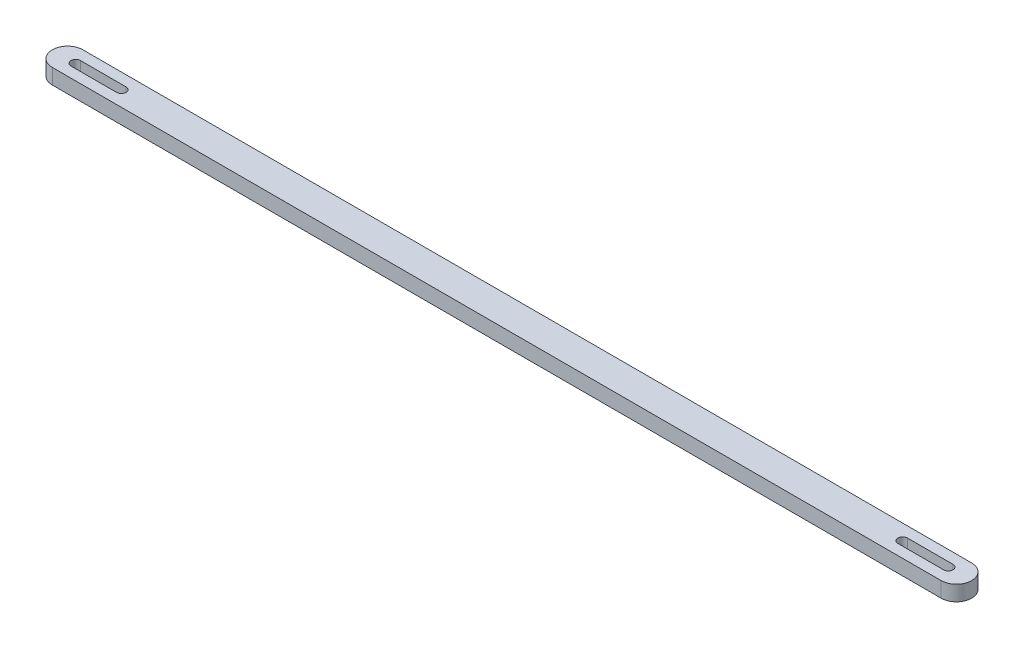
ISO-10303-21;
HEADER;
FILE_DESCRIPTION(('STEP AP214'),'2;1');
FILE_NAME('part.step','',(''),(''),'','','');
FILE_SCHEMA(('AUTOMOTIVE_DESIGN { 1 0 10303 214 1 1 1 1 }'));
ENDSEC;
DATA;
#1=APPLICATION_CONTEXT('core data for automotive mechanical design processes');
#2=APPLICATION_PROTOCOL_DEFINITION('international standard','automotive_design',2000,#1);
#3=PRODUCT_CONTEXT('',#1,'mechanical');
#4=PRODUCT('Part','Part','',(#3));
#5=PRODUCT_RELATED_PRODUCT_CATEGORY('part','',(#4));
#6=PRODUCT_DEFINITION_FORMATION('','',#4);
#7=PRODUCT_DEFINITION_CONTEXT('part definition',#1,'design');
#8=PRODUCT_DEFINITION('design','',#6,#7);
#9=PRODUCT_DEFINITION_SHAPE('','',#8);
#10=(LENGTH_UNIT() NAMED_UNIT(*) SI_UNIT(.MILLI.,.METRE.));
#11=(NAMED_UNIT(*) PLANE_ANGLE_UNIT() SI_UNIT($,.RADIAN.));
#12=(NAMED_UNIT(*) SI_UNIT($,.STERADIAN.) SOLID_ANGLE_UNIT());
#13=UNCERTAINTY_MEASURE_WITH_UNIT(LENGTH_MEASURE(1.E-05),#10,'distance_accuracy_value','');
#14=(GEOMETRIC_REPRESENTATION_CONTEXT(3) GLOBAL_UNCERTAINTY_ASSIGNED_CONTEXT((#13)) GLOBAL_UNIT_ASSIGNED_CONTEXT((#10,
#11,#12)) REPRESENTATION_CONTEXT('',''));
#15=CARTESIAN_POINT('',(0.,0.,0.));
#16=DIRECTION('',(0.,0.,1.));
#17=DIRECTION('',(1.,0.,0.));
#18=AXIS2_PLACEMENT_3D('',#15,#16,#17);
#19=CARTESIAN_POINT('',(-145.5,5.,0.));
#20=DIRECTION('',(0.,1.,0.));
#21=DIRECTION('',(0.,0.,1.));
#22=AXIS2_PLACEMENT_3D('',#19,#20,#21);
#23=PLANE('',#22);
#24=CARTESIAN_POINT('',(-145.5,5.,0.));
#25=DIRECTION('',(0.,1.,0.));
#26=DIRECTION('',(0.,0.,1.));
#27=AXIS2_PLACEMENT_3D('',#24,#25,#26);
#28=CIRCLE('',#27,5.);
#29=CARTESIAN_POINT('',(-145.5,5.,-5.));
#30=VERTEX_POINT('',#29);
#31=CARTESIAN_POINT('',(-145.5,5.,5.));
#32=VERTEX_POINT('',#31);
#33=EDGE_CURVE('E189',#30,#32,#28,.T.);
#34=ORIENTED_EDGE('',*,*,#33,.T.);
#35=DIRECTION('',(1.,0.,0.));
#36=VECTOR('',#35,1.);
#37=CARTESIAN_POINT('',(-145.5,5.,5.));
#38=LINE('',#37,#36);
#39=CARTESIAN_POINT('',(145.5,5.,4.99999999999995));
#40=VERTEX_POINT('',#39);
#41=EDGE_CURVE('E192',#32,#40,#38,.T.);
#42=ORIENTED_EDGE('',*,*,#41,.T.);
#43=CARTESIAN_POINT('',(145.5,5.,0.));
#44=DIRECTION('',(0.,1.,0.));
#45=DIRECTION('',(0.,0.,1.));
#46=AXIS2_PLACEMENT_3D('',#43,#44,#45);
#47=CIRCLE('',#46,5.);
#48=CARTESIAN_POINT('',(145.5,5.,-5.00000000000004));
#49=VERTEX_POINT('',#48);
#50=EDGE_CURVE('E195',#40,#49,#47,.T.);
#51=ORIENTED_EDGE('',*,*,#50,.T.);
#52=DIRECTION('',(-1.,0.,0.));
#53=VECTOR('',#52,1.);
#54=CARTESIAN_POINT('',(-145.5,5.,-5.));
#55=LINE('',#54,#53);
#56=EDGE_CURVE('E197',#49,#30,#55,.T.);
#57=ORIENTED_EDGE('',*,*,#56,.T.);
#58=EDGE_LOOP('',(#34,#42,#51,#57));
#59=FACE_BOUND('',#58,.T.);
#60=DIRECTION('',(-1.,0.,0.));
#61=VECTOR('',#60,1.);
#62=CARTESIAN_POINT('',(-127.890062180922,5.,-1.54999999999991));
#63=LINE('',#62,#61);
#64=CARTESIAN_POINT('',(-127.890062180922,5.,-1.54999999999991));
#65=VERTEX_POINT('',#64);
#66=CARTESIAN_POINT('',(-142.830345758142,5.,-1.54999999999993));
#67=VERTEX_POINT('',#66);
#68=EDGE_CURVE('E160',#65,#67,#63,.T.);
#69=ORIENTED_EDGE('',*,*,#68,.F.);
#70=CARTESIAN_POINT('',(-127.890062180922,5.,0.));
#71=DIRECTION('',(0.,1.,0.));
#72=DIRECTION('',(0.,0.,1.));
#73=AXIS2_PLACEMENT_3D('',#70,#71,#72);
#74=CIRCLE('',#73,1.54999999999994);
#75=CARTESIAN_POINT('',(-127.890062180922,5.,1.54999999999997));
#76=VERTEX_POINT('',#75);
#77=EDGE_CURVE('E158',#76,#65,#74,.T.);
#78=ORIENTED_EDGE('',*,*,#77,.F.);
#79=DIRECTION('',(1.,0.,0.));
#80=VECTOR('',#79,1.);
#81=CARTESIAN_POINT('',(-127.890062180922,5.,1.54999999999997));
#82=LINE('',#81,#80);
#83=CARTESIAN_POINT('',(-142.830345758142,5.,1.54999999999997));
#84=VERTEX_POINT('',#83);
#85=EDGE_CURVE('E166',#84,#76,#82,.T.);
#86=ORIENTED_EDGE('',*,*,#85,.F.);
#87=CARTESIAN_POINT('',(-142.830345758142,5.,0.));
#88=DIRECTION('',(0.,1.,0.));
#89=DIRECTION('',(0.,0.,1.));
#90=AXIS2_PLACEMENT_3D('',#87,#88,#89);
#91=CIRCLE('',#90,1.54999999999993);
#92=EDGE_CURVE('E163',#67,#84,#91,.T.);
#93=ORIENTED_EDGE('',*,*,#92,.F.);
#94=EDGE_LOOP('',(#69,#78,#86,#93));
#95=FACE_BOUND('',#94,.T.);
#96=DIRECTION('',(1.,0.,0.));
#97=VECTOR('',#96,1.);
#98=CARTESIAN_POINT('',(127.890062180922,5.,1.54999999999994));
#99=LINE('',#98,#97);
#100=CARTESIAN_POINT('',(127.890062180922,5.,1.54999999999994));
#101=VERTEX_POINT('',#100);
#102=CARTESIAN_POINT('',(142.830345758142,5.,1.54999999999993));
#103=VERTEX_POINT('',#102);
#104=EDGE_CURVE('E130',#101,#103,#99,.T.);
#105=ORIENTED_EDGE('',*,*,#104,.F.);
#106=CARTESIAN_POINT('',(127.890062180922,5.,0.));
#107=DIRECTION('',(0.,1.,0.));
#108=DIRECTION('',(0.,0.,-1.));
#109=AXIS2_PLACEMENT_3D('',#106,#107,#108);
#110=CIRCLE('',#109,1.54999999999994);
#111=CARTESIAN_POINT('',(127.890062180922,5.,-1.54999999999994));
#112=VERTEX_POINT('',#111);
#113=EDGE_CURVE('E122',#112,#101,#110,.T.);
#114=ORIENTED_EDGE('',*,*,#113,.F.);
#115=DIRECTION('',(-1.,0.,0.));
#116=VECTOR('',#115,1.);
#117=CARTESIAN_POINT('',(127.890062180922,5.,-1.54999999999994));
#118=LINE('',#117,#116);
#119=CARTESIAN_POINT('',(142.830345758142,5.,-1.54999999999993));
#120=VERTEX_POINT('',#119);
#121=EDGE_CURVE('E144',#120,#112,#118,.T.);
#122=ORIENTED_EDGE('',*,*,#121,.F.);
#123=CARTESIAN_POINT('',(142.830345758142,5.,0.));
#124=DIRECTION('',(0.,1.,0.));
#125=DIRECTION('',(0.,0.,-1.));
#126=AXIS2_PLACEMENT_3D('',#123,#124,#125);
#127=CIRCLE('',#126,1.54999999999993);
#128=EDGE_CURVE('E142',#103,#120,#127,.T.);
#129=ORIENTED_EDGE('',*,*,#128,.F.);
#130=EDGE_LOOP('',(#105,#114,#122,#129));
#131=FACE_BOUND('',#130,.T.);
#132=ADVANCED_FACE('F33',(#59,#95,#131),#23,.T.);
#133=CARTESIAN_POINT('',(-145.5,0.,0.));
#134=DIRECTION('',(0.,1.,0.));
#135=DIRECTION('',(0.,0.,1.));
#136=AXIS2_PLACEMENT_3D('',#133,#134,#135);
#137=PLANE('',#136);
#138=CARTESIAN_POINT('',(-127.890062180922,0.,0.));
#139=DIRECTION('',(0.,1.,0.));
#140=DIRECTION('',(0.,0.,1.));
#141=AXIS2_PLACEMENT_3D('',#138,#139,#140);
#142=CIRCLE('',#141,1.54999999999994);
#143=CARTESIAN_POINT('',(-127.890062180922,0.,1.54999999999997));
#144=VERTEX_POINT('',#143);
#145=CARTESIAN_POINT('',(-127.890062180922,0.,-1.54999999999991));
#146=VERTEX_POINT('',#145);
#147=EDGE_CURVE('E138',#144,#146,#142,.T.);
#148=ORIENTED_EDGE('',*,*,#147,.T.);
#149=DIRECTION('',(-1.,0.,0.));
#150=VECTOR('',#149,1.);
#151=CARTESIAN_POINT('',(-127.890062180922,0.,-1.54999999999991));
#152=LINE('',#151,#150);
#153=CARTESIAN_POINT('',(-142.830345758142,0.,-1.54999999999993));
#154=VERTEX_POINT('',#153);
#155=EDGE_CURVE('E171',#146,#154,#152,.T.);
#156=ORIENTED_EDGE('',*,*,#155,.T.);
#157=CARTESIAN_POINT('',(-142.830345758142,0.,0.));
#158=DIRECTION('',(0.,1.,0.));
#159=DIRECTION('',(0.,0.,1.));
#160=AXIS2_PLACEMENT_3D('',#157,#158,#159);
#161=CIRCLE('',#160,1.54999999999993);
#162=CARTESIAN_POINT('',(-142.830345758142,0.,1.54999999999997));
#163=VERTEX_POINT('',#162);
#164=EDGE_CURVE('E174',#154,#163,#161,.T.);
#165=ORIENTED_EDGE('',*,*,#164,.T.);
#166=DIRECTION('',(1.,0.,0.));
#167=VECTOR('',#166,1.);
#168=CARTESIAN_POINT('',(-127.890062180922,0.,1.54999999999997));
#169=LINE('',#168,#167);
#170=EDGE_CURVE('E161',#163,#144,#169,.T.);
#171=ORIENTED_EDGE('',*,*,#170,.T.);
#172=EDGE_LOOP('',(#148,#156,#165,#171));
#173=FACE_BOUND('',#172,.T.);
#174=CARTESIAN_POINT('',(-145.5,0.,0.));
#175=DIRECTION('',(0.,1.,0.));
#176=DIRECTION('',(0.,0.,1.));
#177=AXIS2_PLACEMENT_3D('',#174,#175,#176);
#178=CIRCLE('',#177,5.);
#179=CARTESIAN_POINT('',(-145.5,0.,-5.));
#180=VERTEX_POINT('',#179);
#181=CARTESIAN_POINT('',(-145.5,0.,5.));
#182=VERTEX_POINT('',#181);
#183=EDGE_CURVE('E188',#180,#182,#178,.T.);
#184=ORIENTED_EDGE('',*,*,#183,.F.);
#185=DIRECTION('',(-1.,0.,0.));
#186=VECTOR('',#185,1.);
#187=CARTESIAN_POINT('',(-145.5,0.,-5.));
#188=LINE('',#187,#186);
#189=CARTESIAN_POINT('',(145.5,0.,-5.00000000000004));
#190=VERTEX_POINT('',#189);
#191=EDGE_CURVE('E193',#190,#180,#188,.T.);
#192=ORIENTED_EDGE('',*,*,#191,.F.);
#193=CARTESIAN_POINT('',(145.5,0.,0.));
#194=DIRECTION('',(0.,1.,0.));
#195=DIRECTION('',(0.,0.,1.));
#196=AXIS2_PLACEMENT_3D('',#193,#194,#195);
#197=CIRCLE('',#196,5.);
#198=CARTESIAN_POINT('',(145.5,0.,4.99999999999995));
#199=VERTEX_POINT('',#198);
#200=EDGE_CURVE('E204',#199,#190,#197,.T.);
#201=ORIENTED_EDGE('',*,*,#200,.F.);
#202=DIRECTION('',(1.,0.,0.));
#203=VECTOR('',#202,1.);
#204=CARTESIAN_POINT('',(-145.5,0.,5.));
#205=LINE('',#204,#203);
#206=EDGE_CURVE('E202',#182,#199,#205,.T.);
#207=ORIENTED_EDGE('',*,*,#206,.F.);
#208=EDGE_LOOP('',(#184,#192,#201,#207));
#209=FACE_BOUND('',#208,.T.);
#210=CARTESIAN_POINT('',(127.890062180922,0.,0.));
#211=DIRECTION('',(0.,1.,0.));
#212=DIRECTION('',(0.,0.,-1.));
#213=AXIS2_PLACEMENT_3D('',#210,#211,#212);
#214=CIRCLE('',#213,1.54999999999994);
#215=CARTESIAN_POINT('',(127.890062180922,0.,-1.54999999999994));
#216=VERTEX_POINT('',#215);
#217=CARTESIAN_POINT('',(127.890062180922,0.,1.54999999999994));
#218=VERTEX_POINT('',#217);
#219=EDGE_CURVE('E56',#216,#218,#214,.T.);
#220=ORIENTED_EDGE('',*,*,#219,.T.);
#221=DIRECTION('',(1.,0.,0.));
#222=VECTOR('',#221,1.);
#223=CARTESIAN_POINT('',(127.890062180922,0.,1.54999999999994));
#224=LINE('',#223,#222);
#225=CARTESIAN_POINT('',(142.830345758142,0.,1.54999999999993));
#226=VERTEX_POINT('',#225);
#227=EDGE_CURVE('E137',#218,#226,#224,.T.);
#228=ORIENTED_EDGE('',*,*,#227,.T.);
#229=CARTESIAN_POINT('',(142.830345758142,0.,0.));
#230=DIRECTION('',(0.,1.,0.));
#231=DIRECTION('',(0.,0.,-1.));
#232=AXIS2_PLACEMENT_3D('',#229,#230,#231);
#233=CIRCLE('',#232,1.54999999999993);
#234=CARTESIAN_POINT('',(142.830345758142,0.,-1.54999999999993));
#235=VERTEX_POINT('',#234);
#236=EDGE_CURVE('E150',#226,#235,#233,.T.);
#237=ORIENTED_EDGE('',*,*,#236,.T.);
#238=DIRECTION('',(-1.,0.,0.));
#239=VECTOR('',#238,1.);
#240=CARTESIAN_POINT('',(127.890062180922,0.,-1.54999999999994));
#241=LINE('',#240,#239);
#242=EDGE_CURVE('E131',#235,#216,#241,.T.);
#243=ORIENTED_EDGE('',*,*,#242,.T.);
#244=EDGE_LOOP('',(#220,#228,#237,#243));
#245=FACE_BOUND('',#244,.T.);
#246=ADVANCED_FACE('F222',(#173,#209,#245),#137,.F.);
#247=CARTESIAN_POINT('',(-145.5,5.,0.));
#248=DIRECTION('',(0.,-1.,0.));
#249=DIRECTION('',(0.,0.,-1.));
#250=AXIS2_PLACEMENT_3D('',#247,#248,#249);
#251=CYLINDRICAL_SURFACE('',#250,5.);
#252=ORIENTED_EDGE('',*,*,#183,.T.);
#253=DIRECTION('',(0.,-1.,0.));
#254=VECTOR('',#253,1.);
#255=CARTESIAN_POINT('',(-145.5,5.,5.));
#256=LINE('',#255,#254);
#257=EDGE_CURVE('E11',#32,#182,#256,.T.);
#258=ORIENTED_EDGE('',*,*,#257,.F.);
#259=ORIENTED_EDGE('',*,*,#33,.F.);
#260=DIRECTION('',(0.,-1.,0.));
#261=VECTOR('',#260,1.);
#262=CARTESIAN_POINT('',(-145.5,5.,-5.));
#263=LINE('',#262,#261);
#264=EDGE_CURVE('E199',#30,#180,#263,.T.);
#265=ORIENTED_EDGE('',*,*,#264,.T.);
#266=EDGE_LOOP('',(#252,#258,#259,#265));
#267=FACE_BOUND('',#266,.T.);
#268=ADVANCED_FACE('F35',(#267),#251,.T.);
#269=CARTESIAN_POINT('',(-145.5,5.,5.));
#270=DIRECTION('',(0.,0.,-1.));
#271=DIRECTION('',(-1.,0.,0.));
#272=AXIS2_PLACEMENT_3D('',#269,#270,#271);
#273=PLANE('',#272);
#274=ORIENTED_EDGE('',*,*,#206,.T.);
#275=DIRECTION('',(0.,-1.,0.));
#276=VECTOR('',#275,1.);
#277=CARTESIAN_POINT('',(145.5,5.,4.99999999999995));
#278=LINE('',#277,#276);
#279=EDGE_CURVE('E41',#40,#199,#278,.T.);
#280=ORIENTED_EDGE('',*,*,#279,.F.);
#281=ORIENTED_EDGE('',*,*,#41,.F.);
#282=ORIENTED_EDGE('',*,*,#257,.T.);
#283=EDGE_LOOP('',(#274,#280,#281,#282));
#284=FACE_BOUND('',#283,.T.);
#285=ADVANCED_FACE('F233',(#284),#273,.F.);
#286=CARTESIAN_POINT('',(145.5,5.,0.));
#287=DIRECTION('',(0.,-1.,0.));
#288=DIRECTION('',(0.,0.,-1.));
#289=AXIS2_PLACEMENT_3D('',#286,#287,#288);
#290=CYLINDRICAL_SURFACE('',#289,5.);
#291=ORIENTED_EDGE('',*,*,#200,.T.);
#292=DIRECTION('',(0.,-1.,0.));
#293=VECTOR('',#292,1.);
#294=CARTESIAN_POINT('',(145.5,5.,-5.00000000000004));
#295=LINE('',#294,#293);
#296=EDGE_CURVE('E209',#49,#190,#295,.T.);
#297=ORIENTED_EDGE('',*,*,#296,.F.);
#298=ORIENTED_EDGE('',*,*,#50,.F.);
#299=ORIENTED_EDGE('',*,*,#279,.T.);
#300=EDGE_LOOP('',(#291,#297,#298,#299));
#301=FACE_BOUND('',#300,.T.);
#302=ADVANCED_FACE('F216',(#301),#290,.T.);
#303=CARTESIAN_POINT('',(-145.5,5.,-5.));
#304=DIRECTION('',(0.,0.,1.));
#305=DIRECTION('',(1.,0.,0.));
#306=AXIS2_PLACEMENT_3D('',#303,#304,#305);
#307=PLANE('',#306);
#308=ORIENTED_EDGE('',*,*,#191,.T.);
#309=ORIENTED_EDGE('',*,*,#264,.F.);
#310=ORIENTED_EDGE('',*,*,#56,.F.);
#311=ORIENTED_EDGE('',*,*,#296,.T.);
#312=EDGE_LOOP('',(#308,#309,#310,#311));
#313=FACE_BOUND('',#312,.T.);
#314=ADVANCED_FACE('F226',(#313),#307,.F.);
#315=CARTESIAN_POINT('',(-127.890062180922,5.,0.));
#316=DIRECTION('',(0.,-1.,0.));
#317=DIRECTION('',(0.,0.,-1.));
#318=AXIS2_PLACEMENT_3D('',#315,#316,#317);
#319=CYLINDRICAL_SURFACE('',#318,1.54999999999994);
#320=ORIENTED_EDGE('',*,*,#147,.F.);
#321=DIRECTION('',(0.,-1.,0.));
#322=VECTOR('',#321,1.);
#323=CARTESIAN_POINT('',(-127.890062180922,5.,1.54999999999997));
#324=LINE('',#323,#322);
#325=EDGE_CURVE('E168',#76,#144,#324,.T.);
#326=ORIENTED_EDGE('',*,*,#325,.F.);
#327=ORIENTED_EDGE('',*,*,#77,.T.);
#328=DIRECTION('',(0.,-1.,0.));
#329=VECTOR('',#328,1.);
#330=CARTESIAN_POINT('',(-127.890062180922,5.,-1.54999999999991));
#331=LINE('',#330,#329);
#332=EDGE_CURVE('E185',#65,#146,#331,.T.);
#333=ORIENTED_EDGE('',*,*,#332,.T.);
#334=EDGE_LOOP('',(#320,#326,#327,#333));
#335=FACE_BOUND('',#334,.T.);
#336=ADVANCED_FACE('F248',(#335),#319,.F.);
#337=CARTESIAN_POINT('',(-127.890062180922,5.,-1.54999999999991));
#338=DIRECTION('',(0.,0.,1.));
#339=DIRECTION('',(1.,0.,0.));
#340=AXIS2_PLACEMENT_3D('',#337,#338,#339);
#341=PLANE('',#340);
#342=ORIENTED_EDGE('',*,*,#155,.F.);
#343=ORIENTED_EDGE('',*,*,#332,.F.);
#344=ORIENTED_EDGE('',*,*,#68,.T.);
#345=DIRECTION('',(0.,-1.,0.));
#346=VECTOR('',#345,1.);
#347=CARTESIAN_POINT('',(-142.830345758142,5.,-1.54999999999993));
#348=LINE('',#347,#346);
#349=EDGE_CURVE('E183',#67,#154,#348,.T.);
#350=ORIENTED_EDGE('',*,*,#349,.T.);
#351=EDGE_LOOP('',(#342,#343,#344,#350));
#352=FACE_BOUND('',#351,.T.);
#353=ADVANCED_FACE('F255',(#352),#341,.T.);
#354=CARTESIAN_POINT('',(-142.830345758142,5.,0.));
#355=DIRECTION('',(0.,-1.,0.));
#356=DIRECTION('',(0.,0.,-1.));
#357=AXIS2_PLACEMENT_3D('',#354,#355,#356);
#358=CYLINDRICAL_SURFACE('',#357,1.54999999999993);
#359=ORIENTED_EDGE('',*,*,#164,.F.);
#360=ORIENTED_EDGE('',*,*,#349,.F.);
#361=ORIENTED_EDGE('',*,*,#92,.T.);
#362=DIRECTION('',(0.,-1.,0.));
#363=VECTOR('',#362,1.);
#364=CARTESIAN_POINT('',(-142.830345758142,5.,1.54999999999997));
#365=LINE('',#364,#363);
#366=EDGE_CURVE('E181',#84,#163,#365,.T.);
#367=ORIENTED_EDGE('',*,*,#366,.T.);
#368=EDGE_LOOP('',(#359,#360,#361,#367));
#369=FACE_BOUND('',#368,.T.);
#370=ADVANCED_FACE('F260',(#369),#358,.F.);
#371=CARTESIAN_POINT('',(-127.890062180922,5.,1.54999999999997));
#372=DIRECTION('',(0.,0.,-1.));
#373=DIRECTION('',(-1.,0.,0.));
#374=AXIS2_PLACEMENT_3D('',#371,#372,#373);
#375=PLANE('',#374);
#376=ORIENTED_EDGE('',*,*,#170,.F.);
#377=ORIENTED_EDGE('',*,*,#366,.F.);
#378=ORIENTED_EDGE('',*,*,#85,.T.);
#379=ORIENTED_EDGE('',*,*,#325,.T.);
#380=EDGE_LOOP('',(#376,#377,#378,#379));
#381=FACE_BOUND('',#380,.T.);
#382=ADVANCED_FACE('F267',(#381),#375,.T.);
#383=CARTESIAN_POINT('',(127.890062180922,5.,0.));
#384=DIRECTION('',(0.,-1.,0.));
#385=DIRECTION('',(0.,0.,-1.));
#386=AXIS2_PLACEMENT_3D('',#383,#384,#385);
#387=CYLINDRICAL_SURFACE('',#386,1.54999999999994);
#388=ORIENTED_EDGE('',*,*,#219,.F.);
#389=DIRECTION('',(0.,-1.,0.));
#390=VECTOR('',#389,1.);
#391=CARTESIAN_POINT('',(127.890062180922,5.,-1.54999999999994));
#392=LINE('',#391,#390);
#393=EDGE_CURVE('E126',#112,#216,#392,.T.);
#394=ORIENTED_EDGE('',*,*,#393,.F.);
#395=ORIENTED_EDGE('',*,*,#113,.T.);
#396=DIRECTION('',(0.,-1.,0.));
#397=VECTOR('',#396,1.);
#398=CARTESIAN_POINT('',(127.890062180922,5.,1.54999999999994));
#399=LINE('',#398,#397);
#400=EDGE_CURVE('E125',#101,#218,#399,.T.);
#401=ORIENTED_EDGE('',*,*,#400,.T.);
#402=EDGE_LOOP('',(#388,#394,#395,#401));
#403=FACE_BOUND('',#402,.T.);
#404=ADVANCED_FACE('F124',(#403),#387,.F.);
#405=CARTESIAN_POINT('',(127.890062180922,5.,1.54999999999994));
#406=DIRECTION('',(0.,0.,-1.));
#407=DIRECTION('',(-1.,0.,0.));
#408=AXIS2_PLACEMENT_3D('',#405,#406,#407);
#409=PLANE('',#408);
#410=ORIENTED_EDGE('',*,*,#227,.F.);
#411=ORIENTED_EDGE('',*,*,#400,.F.);
#412=ORIENTED_EDGE('',*,*,#104,.T.);
#413=DIRECTION('',(0.,-1.,0.));
#414=VECTOR('',#413,1.);
#415=CARTESIAN_POINT('',(142.830345758142,5.,1.54999999999993));
#416=LINE('',#415,#414);
#417=EDGE_CURVE('E139',#103,#226,#416,.T.);
#418=ORIENTED_EDGE('',*,*,#417,.T.);
#419=EDGE_LOOP('',(#410,#411,#412,#418));
#420=FACE_BOUND('',#419,.T.);
#421=ADVANCED_FACE('F134',(#420),#409,.T.);
#422=CARTESIAN_POINT('',(142.830345758142,5.,0.));
#423=DIRECTION('',(0.,-1.,0.));
#424=DIRECTION('',(0.,0.,-1.));
#425=AXIS2_PLACEMENT_3D('',#422,#423,#424);
#426=CYLINDRICAL_SURFACE('',#425,1.54999999999993);
#427=ORIENTED_EDGE('',*,*,#236,.F.);
#428=ORIENTED_EDGE('',*,*,#417,.F.);
#429=ORIENTED_EDGE('',*,*,#128,.T.);
#430=DIRECTION('',(0.,-1.,0.));
#431=VECTOR('',#430,1.);
#432=CARTESIAN_POINT('',(142.830345758142,5.,-1.54999999999993));
#433=LINE('',#432,#431);
#434=EDGE_CURVE('E48',#120,#235,#433,.T.);
#435=ORIENTED_EDGE('',*,*,#434,.T.);
#436=EDGE_LOOP('',(#427,#428,#429,#435));
#437=FACE_BOUND('',#436,.T.);
#438=ADVANCED_FACE('F285',(#437),#426,.F.);
#439=CARTESIAN_POINT('',(127.890062180922,5.,-1.54999999999994));
#440=DIRECTION('',(0.,0.,1.));
#441=DIRECTION('',(1.,0.,0.));
#442=AXIS2_PLACEMENT_3D('',#439,#440,#441);
#443=PLANE('',#442);
#444=ORIENTED_EDGE('',*,*,#242,.F.);
#445=ORIENTED_EDGE('',*,*,#434,.F.);
#446=ORIENTED_EDGE('',*,*,#121,.T.);
#447=ORIENTED_EDGE('',*,*,#393,.T.);
#448=EDGE_LOOP('',(#444,#445,#446,#447));
#449=FACE_BOUND('',#448,.T.);
#450=ADVANCED_FACE('F288',(#449),#443,.T.);
#451=CLOSED_SHELL('',(#132,#246,#268,#285,#302,#314,#336,#353,#370,#382,#404,#421,#438,#450));
#452=MANIFOLD_SOLID_BREP('B2',#451);
#453=ADVANCED_BREP_SHAPE_REPRESENTATION('',(#18,#452),#14);
#454=SHAPE_DEFINITION_REPRESENTATION(#9,#453);
ENDSEC;
END-ISO-10303-21;
